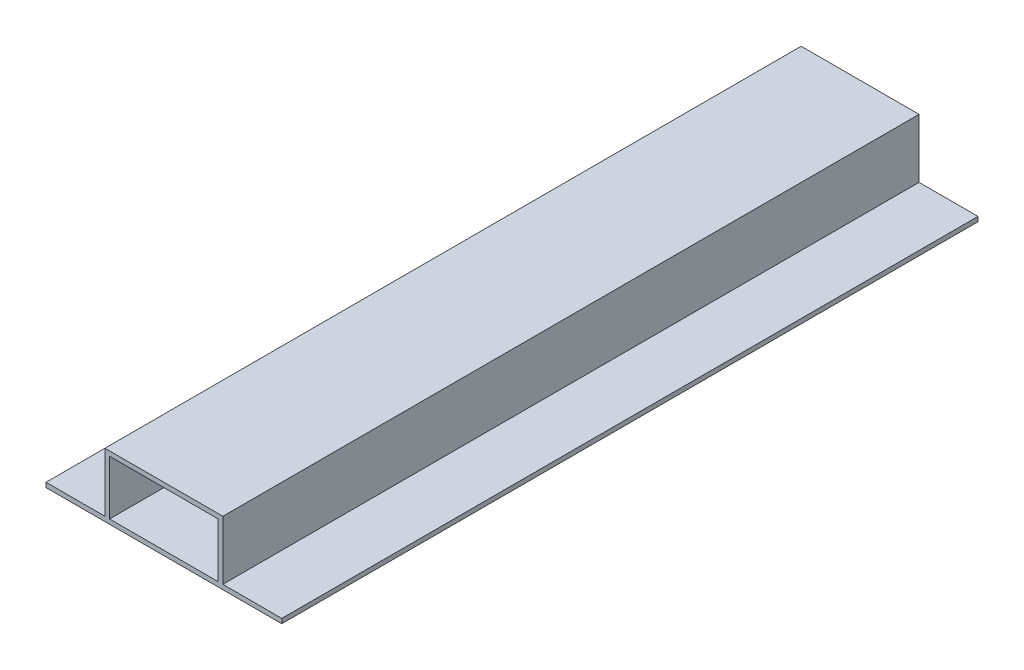
ISO-10303-21;
HEADER;
FILE_DESCRIPTION(('STEP AP214'),'2;1');
FILE_NAME('part.step','',(''),(''),'','','');
FILE_SCHEMA(('AUTOMOTIVE_DESIGN { 1 0 10303 214 1 1 1 1 }'));
ENDSEC;
DATA;
#1=APPLICATION_CONTEXT('core data for automotive mechanical design processes');
#2=APPLICATION_PROTOCOL_DEFINITION('international standard','automotive_design',2000,#1);
#3=PRODUCT_CONTEXT('',#1,'mechanical');
#4=PRODUCT('Part','Part','',(#3));
#5=PRODUCT_RELATED_PRODUCT_CATEGORY('part','',(#4));
#6=PRODUCT_DEFINITION_FORMATION('','',#4);
#7=PRODUCT_DEFINITION_CONTEXT('part definition',#1,'design');
#8=PRODUCT_DEFINITION('design','',#6,#7);
#9=PRODUCT_DEFINITION_SHAPE('','',#8);
#10=(LENGTH_UNIT() NAMED_UNIT(*) SI_UNIT(.MILLI.,.METRE.));
#11=(NAMED_UNIT(*) PLANE_ANGLE_UNIT() SI_UNIT($,.RADIAN.));
#12=(NAMED_UNIT(*) SI_UNIT($,.STERADIAN.) SOLID_ANGLE_UNIT());
#13=UNCERTAINTY_MEASURE_WITH_UNIT(LENGTH_MEASURE(1.E-05),#10,'distance_accuracy_value','');
#14=(GEOMETRIC_REPRESENTATION_CONTEXT(3) GLOBAL_UNCERTAINTY_ASSIGNED_CONTEXT((#13)) GLOBAL_UNIT_ASSIGNED_CONTEXT((#10,
#11,#12)) REPRESENTATION_CONTEXT('',''));
#15=CARTESIAN_POINT('',(0.,0.,0.));
#16=DIRECTION('',(0.,0.,1.));
#17=DIRECTION('',(1.,0.,0.));
#18=AXIS2_PLACEMENT_3D('',#15,#16,#17);
#19=CARTESIAN_POINT('',(0.,12.7,75.));
#20=DIRECTION('',(0.,-1.,0.));
#21=DIRECTION('',(1.,0.,0.));
#22=AXIS2_PLACEMENT_3D('',#19,#20,#21);
#23=PLANE('',#22);
#24=DIRECTION('',(-1.,0.,0.));
#25=VECTOR('',#24,1.);
#26=CARTESIAN_POINT('',(0.,12.7,-75.));
#27=LINE('',#26,#25);
#28=CARTESIAN_POINT('',(11.7,12.7,-75.));
#29=VERTEX_POINT('',#28);
#30=CARTESIAN_POINT('',(-11.7,12.7,-75.));
#31=VERTEX_POINT('',#30);
#32=EDGE_CURVE('E181',#29,#31,#27,.T.);
#33=ORIENTED_EDGE('',*,*,#32,.F.);
#34=DIRECTION('',(0.,0.,-1.));
#35=VECTOR('',#34,1.);
#36=CARTESIAN_POINT('',(11.7,12.7,75.));
#37=LINE('',#36,#35);
#38=CARTESIAN_POINT('',(11.7,12.7,75.));
#39=VERTEX_POINT('',#38);
#40=EDGE_CURVE('E11',#39,#29,#37,.T.);
#41=ORIENTED_EDGE('',*,*,#40,.F.);
#42=DIRECTION('',(-1.,0.,0.));
#43=VECTOR('',#42,1.);
#44=CARTESIAN_POINT('',(0.,12.7,75.));
#45=LINE('',#44,#43);
#46=CARTESIAN_POINT('',(-11.7,12.7,75.));
#47=VERTEX_POINT('',#46);
#48=EDGE_CURVE('E143',#39,#47,#45,.T.);
#49=ORIENTED_EDGE('',*,*,#48,.T.);
#50=DIRECTION('',(0.,0.,-1.));
#51=VECTOR('',#50,1.);
#52=CARTESIAN_POINT('',(-11.7,12.7,75.));
#53=LINE('',#52,#51);
#54=EDGE_CURVE('E53',#47,#31,#53,.T.);
#55=ORIENTED_EDGE('',*,*,#54,.T.);
#56=EDGE_LOOP('',(#33,#41,#49,#55));
#57=FACE_BOUND('',#56,.T.);
#58=ADVANCED_FACE('F34',(#57),#23,.T.);
#59=CARTESIAN_POINT('',(11.7,0.,75.));
#60=DIRECTION('',(1.,0.,0.));
#61=DIRECTION('',(0.,1.,0.));
#62=AXIS2_PLACEMENT_3D('',#59,#60,#61);
#63=PLANE('',#62);
#64=DIRECTION('',(0.,-1.,0.));
#65=VECTOR('',#64,1.);
#66=CARTESIAN_POINT('',(11.7,0.,-75.));
#67=LINE('',#66,#65);
#68=CARTESIAN_POINT('',(11.7,1.,-75.));
#69=VERTEX_POINT('',#68);
#70=EDGE_CURVE('E148',#29,#69,#67,.T.);
#71=ORIENTED_EDGE('',*,*,#70,.T.);
#72=DIRECTION('',(0.,0.,-1.));
#73=VECTOR('',#72,1.);
#74=CARTESIAN_POINT('',(11.7,1.,75.));
#75=LINE('',#74,#73);
#76=CARTESIAN_POINT('',(11.7,1.,75.));
#77=VERTEX_POINT('',#76);
#78=EDGE_CURVE('E44',#77,#69,#75,.T.);
#79=ORIENTED_EDGE('',*,*,#78,.F.);
#80=DIRECTION('',(0.,-1.,0.));
#81=VECTOR('',#80,1.);
#82=CARTESIAN_POINT('',(11.7,0.,75.));
#83=LINE('',#82,#81);
#84=EDGE_CURVE('E138',#39,#77,#83,.T.);
#85=ORIENTED_EDGE('',*,*,#84,.F.);
#86=ORIENTED_EDGE('',*,*,#40,.T.);
#87=EDGE_LOOP('',(#71,#79,#85,#86));
#88=FACE_BOUND('',#87,.T.);
#89=ADVANCED_FACE('F146',(#88),#63,.F.);
#90=CARTESIAN_POINT('',(0.,1.,75.));
#91=DIRECTION('',(0.,-1.,0.));
#92=DIRECTION('',(0.,0.,-1.));
#93=AXIS2_PLACEMENT_3D('',#90,#91,#92);
#94=PLANE('',#93);
#95=DIRECTION('',(-1.,0.,0.));
#96=VECTOR('',#95,1.);
#97=CARTESIAN_POINT('',(0.,1.,-75.));
#98=LINE('',#97,#96);
#99=CARTESIAN_POINT('',(-11.7,1.,-75.));
#100=VERTEX_POINT('',#99);
#101=EDGE_CURVE('E178',#69,#100,#98,.T.);
#102=ORIENTED_EDGE('',*,*,#101,.T.);
#103=DIRECTION('',(0.,0.,-1.));
#104=VECTOR('',#103,1.);
#105=CARTESIAN_POINT('',(-11.7,1.,75.));
#106=LINE('',#105,#104);
#107=CARTESIAN_POINT('',(-11.7,1.,75.));
#108=VERTEX_POINT('',#107);
#109=EDGE_CURVE('E91',#108,#100,#106,.T.);
#110=ORIENTED_EDGE('',*,*,#109,.F.);
#111=DIRECTION('',(-1.,0.,0.));
#112=VECTOR('',#111,1.);
#113=CARTESIAN_POINT('',(0.,1.,75.));
#114=LINE('',#113,#112);
#115=EDGE_CURVE('E130',#77,#108,#114,.T.);
#116=ORIENTED_EDGE('',*,*,#115,.F.);
#117=ORIENTED_EDGE('',*,*,#78,.T.);
#118=EDGE_LOOP('',(#102,#110,#116,#117));
#119=FACE_BOUND('',#118,.T.);
#120=ADVANCED_FACE('F132',(#119),#94,.F.);
#121=CARTESIAN_POINT('',(0.,13.7,75.));
#122=DIRECTION('',(0.,1.,0.));
#123=DIRECTION('',(-1.,0.,0.));
#124=AXIS2_PLACEMENT_3D('',#121,#122,#123);
#125=PLANE('',#124);
#126=DIRECTION('',(1.,0.,0.));
#127=VECTOR('',#126,1.);
#128=CARTESIAN_POINT('',(0.,13.7,-75.));
#129=LINE('',#128,#127);
#130=CARTESIAN_POINT('',(-12.7,13.7,-75.));
#131=VERTEX_POINT('',#130);
#132=CARTESIAN_POINT('',(12.7,13.7,-75.));
#133=VERTEX_POINT('',#132);
#134=EDGE_CURVE('E202',#131,#133,#129,.T.);
#135=ORIENTED_EDGE('',*,*,#134,.F.);
#136=DIRECTION('',(0.,0.,-1.));
#137=VECTOR('',#136,1.);
#138=CARTESIAN_POINT('',(-12.7,13.7,75.));
#139=LINE('',#138,#137);
#140=CARTESIAN_POINT('',(-12.7,13.7,75.));
#141=VERTEX_POINT('',#140);
#142=EDGE_CURVE('E38',#141,#131,#139,.T.);
#143=ORIENTED_EDGE('',*,*,#142,.F.);
#144=DIRECTION('',(1.,0.,0.));
#145=VECTOR('',#144,1.);
#146=CARTESIAN_POINT('',(0.,13.7,75.));
#147=LINE('',#146,#145);
#148=CARTESIAN_POINT('',(12.7,13.7,75.));
#149=VERTEX_POINT('',#148);
#150=EDGE_CURVE('E177',#141,#149,#147,.T.);
#151=ORIENTED_EDGE('',*,*,#150,.T.);
#152=DIRECTION('',(0.,0.,-1.));
#153=VECTOR('',#152,1.);
#154=CARTESIAN_POINT('',(12.7,13.7,75.));
#155=LINE('',#154,#153);
#156=EDGE_CURVE('E153',#149,#133,#155,.T.);
#157=ORIENTED_EDGE('',*,*,#156,.T.);
#158=EDGE_LOOP('',(#135,#143,#151,#157));
#159=FACE_BOUND('',#158,.T.);
#160=ADVANCED_FACE('F36',(#159),#125,.T.);
#161=CARTESIAN_POINT('',(-12.7,0.,75.));
#162=DIRECTION('',(1.,0.,0.));
#163=DIRECTION('',(0.,1.,0.));
#164=AXIS2_PLACEMENT_3D('',#161,#162,#163);
#165=PLANE('',#164);
#166=DIRECTION('',(0.,-1.,0.));
#167=VECTOR('',#166,1.);
#168=CARTESIAN_POINT('',(-12.7,0.,-75.));
#169=LINE('',#168,#167);
#170=CARTESIAN_POINT('',(-12.7,1.,-75.));
#171=VERTEX_POINT('',#170);
#172=EDGE_CURVE('E200',#131,#171,#169,.T.);
#173=ORIENTED_EDGE('',*,*,#172,.T.);
#174=DIRECTION('',(0.,0.,-1.));
#175=VECTOR('',#174,1.);
#176=CARTESIAN_POINT('',(-12.7,1.,75.));
#177=LINE('',#176,#175);
#178=CARTESIAN_POINT('',(-12.7,1.,75.));
#179=VERTEX_POINT('',#178);
#180=EDGE_CURVE('E164',#179,#171,#177,.T.);
#181=ORIENTED_EDGE('',*,*,#180,.F.);
#182=DIRECTION('',(0.,-1.,0.));
#183=VECTOR('',#182,1.);
#184=CARTESIAN_POINT('',(-12.7,0.,75.));
#185=LINE('',#184,#183);
#186=EDGE_CURVE('E223',#141,#179,#185,.T.);
#187=ORIENTED_EDGE('',*,*,#186,.F.);
#188=ORIENTED_EDGE('',*,*,#142,.T.);
#189=EDGE_LOOP('',(#173,#181,#187,#188));
#190=FACE_BOUND('',#189,.T.);
#191=ADVANCED_FACE('F237',(#190),#165,.F.);
#192=CARTESIAN_POINT('',(0.,1.00000000000001,75.));
#193=DIRECTION('',(0.,-1.,0.));
#194=DIRECTION('',(1.,0.,0.));
#195=AXIS2_PLACEMENT_3D('',#192,#193,#194);
#196=PLANE('',#195);
#197=DIRECTION('',(-1.,0.,0.));
#198=VECTOR('',#197,1.);
#199=CARTESIAN_POINT('',(0.,1.00000000000001,-75.));
#200=LINE('',#199,#198);
#201=CARTESIAN_POINT('',(-25.4,0.999999999999997,-75.));
#202=VERTEX_POINT('',#201);
#203=EDGE_CURVE('E198',#171,#202,#200,.T.);
#204=ORIENTED_EDGE('',*,*,#203,.T.);
#205=DIRECTION('',(0.,0.,-1.));
#206=VECTOR('',#205,1.);
#207=CARTESIAN_POINT('',(-25.4,0.999999999999997,75.));
#208=LINE('',#207,#206);
#209=CARTESIAN_POINT('',(-25.4,0.999999999999997,75.));
#210=VERTEX_POINT('',#209);
#211=EDGE_CURVE('E163',#210,#202,#208,.T.);
#212=ORIENTED_EDGE('',*,*,#211,.F.);
#213=DIRECTION('',(-1.,0.,0.));
#214=VECTOR('',#213,1.);
#215=CARTESIAN_POINT('',(0.,1.00000000000001,75.));
#216=LINE('',#215,#214);
#217=EDGE_CURVE('E221',#179,#210,#216,.T.);
#218=ORIENTED_EDGE('',*,*,#217,.F.);
#219=ORIENTED_EDGE('',*,*,#180,.T.);
#220=EDGE_LOOP('',(#204,#212,#218,#219));
#221=FACE_BOUND('',#220,.T.);
#222=ADVANCED_FACE('F239',(#221),#196,.F.);
#223=CARTESIAN_POINT('',(-25.4,0.,75.));
#224=DIRECTION('',(-1.,0.,0.));
#225=DIRECTION('',(0.,0.,1.));
#226=AXIS2_PLACEMENT_3D('',#223,#224,#225);
#227=PLANE('',#226);
#228=DIRECTION('',(0.,1.,0.));
#229=VECTOR('',#228,1.);
#230=CARTESIAN_POINT('',(-25.4,0.,-75.));
#231=LINE('',#230,#229);
#232=CARTESIAN_POINT('',(-25.4,0.,-75.));
#233=VERTEX_POINT('',#232);
#234=EDGE_CURVE('E195',#233,#202,#231,.T.);
#235=ORIENTED_EDGE('',*,*,#234,.F.);
#236=DIRECTION('',(0.,0.,-1.));
#237=VECTOR('',#236,1.);
#238=CARTESIAN_POINT('',(-25.4,0.,75.));
#239=LINE('',#238,#237);
#240=CARTESIAN_POINT('',(-25.4,0.,75.));
#241=VERTEX_POINT('',#240);
#242=EDGE_CURVE('E161',#241,#233,#239,.T.);
#243=ORIENTED_EDGE('',*,*,#242,.F.);
#244=DIRECTION('',(0.,1.,0.));
#245=VECTOR('',#244,1.);
#246=CARTESIAN_POINT('',(-25.4,0.,75.));
#247=LINE('',#246,#245);
#248=EDGE_CURVE('E218',#241,#210,#247,.T.);
#249=ORIENTED_EDGE('',*,*,#248,.T.);
#250=ORIENTED_EDGE('',*,*,#211,.T.);
#251=EDGE_LOOP('',(#235,#243,#249,#250));
#252=FACE_BOUND('',#251,.T.);
#253=ADVANCED_FACE('F314',(#252),#227,.T.);
#254=CARTESIAN_POINT('',(0.,0.,75.));
#255=DIRECTION('',(0.,-1.,0.));
#256=DIRECTION('',(0.,0.,-1.));
#257=AXIS2_PLACEMENT_3D('',#254,#255,#256);
#258=PLANE('',#257);
#259=DIRECTION('',(-1.,0.,0.));
#260=VECTOR('',#259,1.);
#261=CARTESIAN_POINT('',(0.,0.,-75.));
#262=LINE('',#261,#260);
#263=CARTESIAN_POINT('',(25.4,0.,-75.));
#264=VERTEX_POINT('',#263);
#265=EDGE_CURVE('E192',#264,#233,#262,.T.);
#266=ORIENTED_EDGE('',*,*,#265,.F.);
#267=DIRECTION('',(0.,0.,-1.));
#268=VECTOR('',#267,1.);
#269=CARTESIAN_POINT('',(25.4,0.,75.));
#270=LINE('',#269,#268);
#271=CARTESIAN_POINT('',(25.4,0.,75.));
#272=VERTEX_POINT('',#271);
#273=EDGE_CURVE('E159',#272,#264,#270,.T.);
#274=ORIENTED_EDGE('',*,*,#273,.F.);
#275=DIRECTION('',(-1.,0.,0.));
#276=VECTOR('',#275,1.);
#277=CARTESIAN_POINT('',(0.,0.,75.));
#278=LINE('',#277,#276);
#279=EDGE_CURVE('E215',#272,#241,#278,.T.);
#280=ORIENTED_EDGE('',*,*,#279,.T.);
#281=ORIENTED_EDGE('',*,*,#242,.T.);
#282=EDGE_LOOP('',(#266,#274,#280,#281));
#283=FACE_BOUND('',#282,.T.);
#284=ADVANCED_FACE('F245',(#283),#258,.T.);
#285=CARTESIAN_POINT('',(25.4,0.,75.));
#286=DIRECTION('',(-1.,0.,0.));
#287=DIRECTION('',(0.,0.,1.));
#288=AXIS2_PLACEMENT_3D('',#285,#286,#287);
#289=PLANE('',#288);
#290=DIRECTION('',(0.,1.,0.));
#291=VECTOR('',#290,1.);
#292=CARTESIAN_POINT('',(25.4,0.,-75.));
#293=LINE('',#292,#291);
#294=CARTESIAN_POINT('',(25.4,0.999999999999997,-75.));
#295=VERTEX_POINT('',#294);
#296=EDGE_CURVE('E189',#264,#295,#293,.T.);
#297=ORIENTED_EDGE('',*,*,#296,.T.);
#298=DIRECTION('',(0.,0.,-1.));
#299=VECTOR('',#298,1.);
#300=CARTESIAN_POINT('',(25.4,0.999999999999997,75.));
#301=LINE('',#300,#299);
#302=CARTESIAN_POINT('',(25.4,0.999999999999997,75.));
#303=VERTEX_POINT('',#302);
#304=EDGE_CURVE('E157',#303,#295,#301,.T.);
#305=ORIENTED_EDGE('',*,*,#304,.F.);
#306=DIRECTION('',(0.,1.,0.));
#307=VECTOR('',#306,1.);
#308=CARTESIAN_POINT('',(25.4,0.,75.));
#309=LINE('',#308,#307);
#310=EDGE_CURVE('E213',#272,#303,#309,.T.);
#311=ORIENTED_EDGE('',*,*,#310,.F.);
#312=ORIENTED_EDGE('',*,*,#273,.T.);
#313=EDGE_LOOP('',(#297,#305,#311,#312));
#314=FACE_BOUND('',#313,.T.);
#315=ADVANCED_FACE('F250',(#314),#289,.F.);
#316=CARTESIAN_POINT('',(0.,1.00000000000001,75.));
#317=DIRECTION('',(0.,1.,0.));
#318=DIRECTION('',(-1.,0.,0.));
#319=AXIS2_PLACEMENT_3D('',#316,#317,#318);
#320=PLANE('',#319);
#321=DIRECTION('',(1.,0.,0.));
#322=VECTOR('',#321,1.);
#323=CARTESIAN_POINT('',(0.,1.00000000000001,-75.));
#324=LINE('',#323,#322);
#325=CARTESIAN_POINT('',(12.7,1.,-75.));
#326=VERTEX_POINT('',#325);
#327=EDGE_CURVE('E186',#326,#295,#324,.T.);
#328=ORIENTED_EDGE('',*,*,#327,.F.);
#329=DIRECTION('',(0.,0.,-1.));
#330=VECTOR('',#329,1.);
#331=CARTESIAN_POINT('',(12.7,1.,75.));
#332=LINE('',#331,#330);
#333=CARTESIAN_POINT('',(12.7,1.,75.));
#334=VERTEX_POINT('',#333);
#335=EDGE_CURVE('E155',#334,#326,#332,.T.);
#336=ORIENTED_EDGE('',*,*,#335,.F.);
#337=DIRECTION('',(1.,0.,0.));
#338=VECTOR('',#337,1.);
#339=CARTESIAN_POINT('',(0.,1.00000000000001,75.));
#340=LINE('',#339,#338);
#341=EDGE_CURVE('E210',#334,#303,#340,.T.);
#342=ORIENTED_EDGE('',*,*,#341,.T.);
#343=ORIENTED_EDGE('',*,*,#304,.T.);
#344=EDGE_LOOP('',(#328,#336,#342,#343));
#345=FACE_BOUND('',#344,.T.);
#346=ADVANCED_FACE('F252',(#345),#320,.T.);
#347=CARTESIAN_POINT('',(12.7,0.,75.));
#348=DIRECTION('',(1.,0.,0.));
#349=DIRECTION('',(0.,1.,0.));
#350=AXIS2_PLACEMENT_3D('',#347,#348,#349);
#351=PLANE('',#350);
#352=DIRECTION('',(0.,-1.,0.));
#353=VECTOR('',#352,1.);
#354=CARTESIAN_POINT('',(12.7,0.,-75.));
#355=LINE('',#354,#353);
#356=EDGE_CURVE('E183',#133,#326,#355,.T.);
#357=ORIENTED_EDGE('',*,*,#356,.F.);
#358=ORIENTED_EDGE('',*,*,#156,.F.);
#359=DIRECTION('',(0.,-1.,0.));
#360=VECTOR('',#359,1.);
#361=CARTESIAN_POINT('',(12.7,0.,75.));
#362=LINE('',#361,#360);
#363=EDGE_CURVE('E207',#149,#334,#362,.T.);
#364=ORIENTED_EDGE('',*,*,#363,.T.);
#365=ORIENTED_EDGE('',*,*,#335,.T.);
#366=EDGE_LOOP('',(#357,#358,#364,#365));
#367=FACE_BOUND('',#366,.T.);
#368=ADVANCED_FACE('F231',(#367),#351,.T.);
#369=CARTESIAN_POINT('',(-11.7,0.,75.));
#370=DIRECTION('',(1.,0.,0.));
#371=DIRECTION('',(0.,1.,0.));
#372=AXIS2_PLACEMENT_3D('',#369,#370,#371);
#373=PLANE('',#372);
#374=DIRECTION('',(0.,-1.,0.));
#375=VECTOR('',#374,1.);
#376=CARTESIAN_POINT('',(-11.7,0.,-75.));
#377=LINE('',#376,#375);
#378=EDGE_CURVE('E174',#31,#100,#377,.T.);
#379=ORIENTED_EDGE('',*,*,#378,.F.);
#380=ORIENTED_EDGE('',*,*,#54,.F.);
#381=DIRECTION('',(0.,-1.,0.));
#382=VECTOR('',#381,1.);
#383=CARTESIAN_POINT('',(-11.7,0.,75.));
#384=LINE('',#383,#382);
#385=EDGE_CURVE('E137',#47,#108,#384,.T.);
#386=ORIENTED_EDGE('',*,*,#385,.T.);
#387=ORIENTED_EDGE('',*,*,#109,.T.);
#388=EDGE_LOOP('',(#379,#380,#386,#387));
#389=FACE_BOUND('',#388,.T.);
#390=ADVANCED_FACE('F259',(#389),#373,.T.);
#391=CARTESIAN_POINT('',(0.,0.,75.));
#392=DIRECTION('',(0.,0.,1.));
#393=DIRECTION('',(1.,0.,0.));
#394=AXIS2_PLACEMENT_3D('',#391,#392,#393);
#395=PLANE('',#394);
#396=ORIENTED_EDGE('',*,*,#150,.F.);
#397=ORIENTED_EDGE('',*,*,#186,.T.);
#398=ORIENTED_EDGE('',*,*,#217,.T.);
#399=ORIENTED_EDGE('',*,*,#248,.F.);
#400=ORIENTED_EDGE('',*,*,#279,.F.);
#401=ORIENTED_EDGE('',*,*,#310,.T.);
#402=ORIENTED_EDGE('',*,*,#341,.F.);
#403=ORIENTED_EDGE('',*,*,#363,.F.);
#404=EDGE_LOOP('',(#396,#397,#398,#399,#400,#401,#402,#403));
#405=FACE_BOUND('',#404,.T.);
#406=ORIENTED_EDGE('',*,*,#48,.F.);
#407=ORIENTED_EDGE('',*,*,#84,.T.);
#408=ORIENTED_EDGE('',*,*,#115,.T.);
#409=ORIENTED_EDGE('',*,*,#385,.F.);
#410=EDGE_LOOP('',(#406,#407,#408,#409));
#411=FACE_BOUND('',#410,.T.);
#412=ADVANCED_FACE('F142',(#405,#411),#395,.T.);
#413=CARTESIAN_POINT('',(0.,0.,-75.));
#414=DIRECTION('',(0.,0.,1.));
#415=DIRECTION('',(1.,0.,0.));
#416=AXIS2_PLACEMENT_3D('',#413,#414,#415);
#417=PLANE('',#416);
#418=ORIENTED_EDGE('',*,*,#134,.T.);
#419=ORIENTED_EDGE('',*,*,#356,.T.);
#420=ORIENTED_EDGE('',*,*,#327,.T.);
#421=ORIENTED_EDGE('',*,*,#296,.F.);
#422=ORIENTED_EDGE('',*,*,#265,.T.);
#423=ORIENTED_EDGE('',*,*,#234,.T.);
#424=ORIENTED_EDGE('',*,*,#203,.F.);
#425=ORIENTED_EDGE('',*,*,#172,.F.);
#426=EDGE_LOOP('',(#418,#419,#420,#421,#422,#423,#424,#425));
#427=FACE_BOUND('',#426,.T.);
#428=ORIENTED_EDGE('',*,*,#32,.T.);
#429=ORIENTED_EDGE('',*,*,#378,.T.);
#430=ORIENTED_EDGE('',*,*,#101,.F.);
#431=ORIENTED_EDGE('',*,*,#70,.F.);
#432=EDGE_LOOP('',(#428,#429,#430,#431));
#433=FACE_BOUND('',#432,.T.);
#434=ADVANCED_FACE('F234',(#427,#433),#417,.F.);
#435=CLOSED_SHELL('',(#58,#89,#120,#160,#191,#222,#253,#284,#315,#346,#368,#390,#412,#434));
#436=MANIFOLD_SOLID_BREP('B2',#435);
#437=ADVANCED_BREP_SHAPE_REPRESENTATION('',(#18,#436),#14);
#438=SHAPE_DEFINITION_REPRESENTATION(#9,#437);
ENDSEC;
END-ISO-10303-21;
